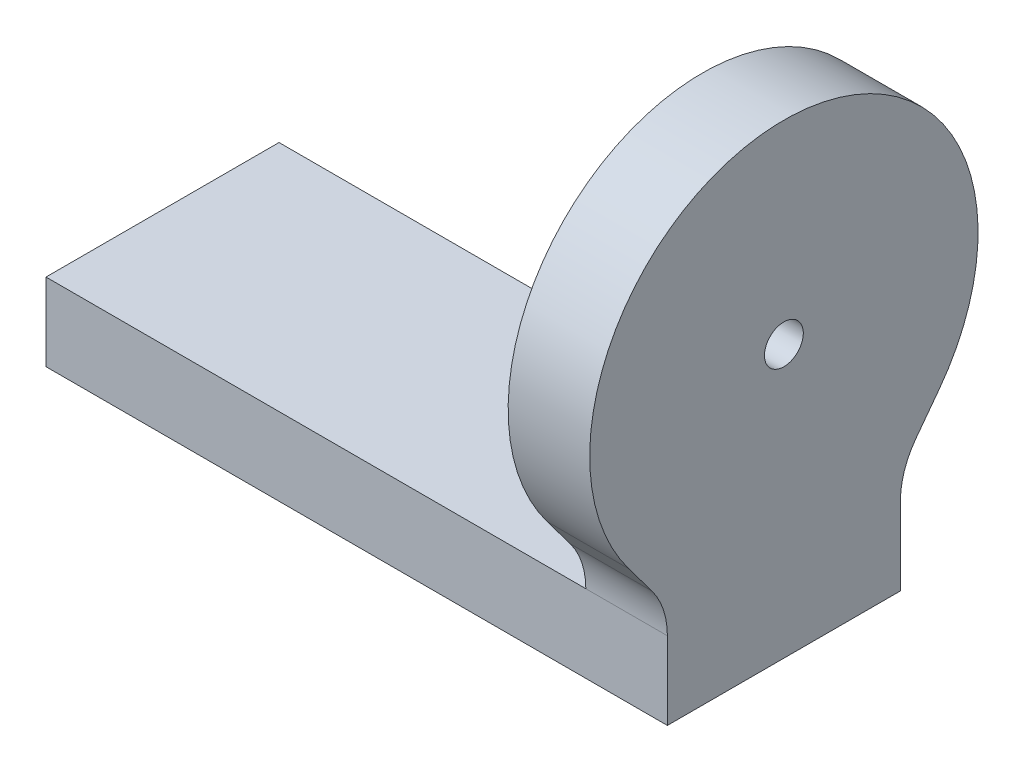
ISO-10303-21;
HEADER;
FILE_DESCRIPTION(('STEP AP214'),'2;1');
FILE_NAME('part.step','',(''),(''),'','','');
FILE_SCHEMA(('AUTOMOTIVE_DESIGN { 1 0 10303 214 1 1 1 1 }'));
ENDSEC;
DATA;
#1=APPLICATION_CONTEXT('core data for automotive mechanical design processes');
#2=APPLICATION_PROTOCOL_DEFINITION('international standard','automotive_design',2000,#1);
#3=PRODUCT_CONTEXT('',#1,'mechanical');
#4=PRODUCT('Part','Part','',(#3));
#5=PRODUCT_RELATED_PRODUCT_CATEGORY('part','',(#4));
#6=PRODUCT_DEFINITION_FORMATION('','',#4);
#7=PRODUCT_DEFINITION_CONTEXT('part definition',#1,'design');
#8=PRODUCT_DEFINITION('design','',#6,#7);
#9=PRODUCT_DEFINITION_SHAPE('','',#8);
#10=(LENGTH_UNIT() NAMED_UNIT(*) SI_UNIT(.MILLI.,.METRE.));
#11=(NAMED_UNIT(*) PLANE_ANGLE_UNIT() SI_UNIT($,.RADIAN.));
#12=(NAMED_UNIT(*) SI_UNIT($,.STERADIAN.) SOLID_ANGLE_UNIT());
#13=UNCERTAINTY_MEASURE_WITH_UNIT(LENGTH_MEASURE(1.E-05),#10,'distance_accuracy_value','');
#14=(GEOMETRIC_REPRESENTATION_CONTEXT(3) GLOBAL_UNCERTAINTY_ASSIGNED_CONTEXT((#13)) GLOBAL_UNIT_ASSIGNED_CONTEXT((#10,
#11,#12)) REPRESENTATION_CONTEXT('',''));
#15=CARTESIAN_POINT('',(0.,0.,0.));
#16=DIRECTION('',(0.,0.,1.));
#17=DIRECTION('',(1.,0.,0.));
#18=AXIS2_PLACEMENT_3D('',#15,#16,#17);
#19=CARTESIAN_POINT('',(29.5,60.,-50.));
#20=DIRECTION('',(-1.,0.,0.));
#21=DIRECTION('',(0.,0.,1.));
#22=AXIS2_PLACEMENT_3D('',#19,#20,#21);
#23=PLANE('',#22);
#24=CARTESIAN_POINT('',(29.5,35.,-25.));
#25=DIRECTION('',(-1.,0.,0.));
#26=DIRECTION('',(0.,0.,1.));
#27=AXIS2_PLACEMENT_3D('',#24,#25,#26);
#28=CIRCLE('',#27,2.5);
#29=CARTESIAN_POINT('',(29.5,35.,-22.5));
#30=VERTEX_POINT('',#29);
#31=EDGE_CURVE('E168',#30,#30,#28,.T.);
#32=ORIENTED_EDGE('',*,*,#31,.F.);
#33=EDGE_LOOP('',(#32));
#34=FACE_BOUND('',#33,.T.);
#35=DIRECTION('',(0.,-0.800010129343293,-0.599986493971429));
#36=VECTOR('',#35,1.);
#37=CARTESIAN_POINT('',(29.5,9.59970286834054,-12.800054018756));
#38=LINE('',#37,#36);
#39=CARTESIAN_POINT('',(29.5,19.9484136276116,-5.03879393236643));
#40=VERTEX_POINT('',#39);
#41=CARTESIAN_POINT('',(29.5,16.,-8.));
#42=VERTEX_POINT('',#41);
#43=EDGE_CURVE('E113',#40,#42,#38,.T.);
#44=ORIENTED_EDGE('',*,*,#43,.F.);
#45=CARTESIAN_POINT('',(29.5,35.,-25.));
#46=DIRECTION('',(-1.,0.,0.));
#47=DIRECTION('',(0.,0.,1.));
#48=AXIS2_PLACEMENT_3D('',#45,#46,#47);
#49=CIRCLE('',#48,25.);
#50=CARTESIAN_POINT('',(29.5,20.,-45.));
#51=VERTEX_POINT('',#50);
#52=EDGE_CURVE('E173',#40,#51,#49,.T.);
#53=ORIENTED_EDGE('',*,*,#52,.T.);
#54=DIRECTION('',(0.,-0.799999999999999,0.600000000000001));
#55=VECTOR('',#54,1.);
#56=CARTESIAN_POINT('',(29.5,-14.4,-19.1999999999999));
#57=LINE('',#56,#55);
#58=CARTESIAN_POINT('',(29.5,16.,-42.));
#59=VERTEX_POINT('',#58);
#60=EDGE_CURVE('E142',#51,#59,#57,.T.);
#61=ORIENTED_EDGE('',*,*,#60,.T.);
#62=CARTESIAN_POINT('',(29.5,10.,-50.));
#63=DIRECTION('',(-1.,0.,0.));
#64=DIRECTION('',(0.,0.,1.));
#65=AXIS2_PLACEMENT_3D('',#62,#63,#64);
#66=CIRCLE('',#65,10.);
#67=CARTESIAN_POINT('',(29.5,10.,-40.));
#68=VERTEX_POINT('',#67);
#69=EDGE_CURVE('E136',#68,#59,#66,.T.);
#70=ORIENTED_EDGE('',*,*,#69,.F.);
#71=DIRECTION('',(0.,0.,1.));
#72=VECTOR('',#71,1.);
#73=CARTESIAN_POINT('',(29.5,10.,-50.));
#74=LINE('',#73,#72);
#75=CARTESIAN_POINT('',(29.5,10.,-10.));
#76=VERTEX_POINT('',#75);
#77=EDGE_CURVE('E41',#68,#76,#74,.T.);
#78=ORIENTED_EDGE('',*,*,#77,.T.);
#79=CARTESIAN_POINT('',(29.5,10.,0.));
#80=DIRECTION('',(-1.,0.,0.));
#81=DIRECTION('',(0.,0.,1.));
#82=AXIS2_PLACEMENT_3D('',#79,#80,#81);
#83=CIRCLE('',#82,10.);
#84=EDGE_CURVE('E131',#42,#76,#83,.T.);
#85=ORIENTED_EDGE('',*,*,#84,.F.);
#86=EDGE_LOOP('',(#44,#53,#61,#70,#78,#85));
#87=FACE_BOUND('',#86,.T.);
#88=ADVANCED_FACE('F32',(#34,#87),#23,.T.);
#89=CARTESIAN_POINT('',(40.,60.,-50.));
#90=DIRECTION('',(-1.,0.,0.));
#91=DIRECTION('',(0.,-1.,0.));
#92=AXIS2_PLACEMENT_3D('',#89,#90,#91);
#93=PLANE('',#92);
#94=CARTESIAN_POINT('',(40.,35.,-25.));
#95=DIRECTION('',(-1.,0.,0.));
#96=DIRECTION('',(0.,0.,1.));
#97=AXIS2_PLACEMENT_3D('',#94,#95,#96);
#98=CIRCLE('',#97,2.5);
#99=CARTESIAN_POINT('',(40.,35.,-22.5));
#100=VERTEX_POINT('',#99);
#101=EDGE_CURVE('E170',#100,#100,#98,.T.);
#102=ORIENTED_EDGE('',*,*,#101,.T.);
#103=EDGE_LOOP('',(#102));
#104=FACE_BOUND('',#103,.T.);
#105=CARTESIAN_POINT('',(40.,35.,-25.));
#106=DIRECTION('',(-1.,0.,0.));
#107=DIRECTION('',(0.,0.,1.));
#108=AXIS2_PLACEMENT_3D('',#105,#106,#107);
#109=CIRCLE('',#108,25.);
#110=CARTESIAN_POINT('',(40.,19.9484136276116,-5.03879393236643));
#111=VERTEX_POINT('',#110);
#112=CARTESIAN_POINT('',(40.,20.,-45.));
#113=VERTEX_POINT('',#112);
#114=EDGE_CURVE('E129',#111,#113,#109,.T.);
#115=ORIENTED_EDGE('',*,*,#114,.F.);
#116=DIRECTION('',(0.,-0.800010129343293,-0.599986493971429));
#117=VECTOR('',#116,1.);
#118=CARTESIAN_POINT('',(40.,9.59970286834054,-12.800054018756));
#119=LINE('',#118,#117);
#120=CARTESIAN_POINT('',(40.,16.,-8.));
#121=VERTEX_POINT('',#120);
#122=EDGE_CURVE('E111',#111,#121,#119,.T.);
#123=ORIENTED_EDGE('',*,*,#122,.T.);
#124=CARTESIAN_POINT('',(40.,10.,0.));
#125=DIRECTION('',(-1.,0.,0.));
#126=DIRECTION('',(0.,0.,1.));
#127=AXIS2_PLACEMENT_3D('',#124,#125,#126);
#128=CIRCLE('',#127,10.);
#129=CARTESIAN_POINT('',(40.,10.,-10.));
#130=VERTEX_POINT('',#129);
#131=EDGE_CURVE('E117',#121,#130,#128,.T.);
#132=ORIENTED_EDGE('',*,*,#131,.T.);
#133=DIRECTION('',(0.,1.,0.));
#134=VECTOR('',#133,1.);
#135=CARTESIAN_POINT('',(40.,0.,-10.));
#136=LINE('',#135,#134);
#137=CARTESIAN_POINT('',(40.,0.,-10.));
#138=VERTEX_POINT('',#137);
#139=EDGE_CURVE('E156',#138,#130,#136,.T.);
#140=ORIENTED_EDGE('',*,*,#139,.F.);
#141=DIRECTION('',(0.,0.,1.));
#142=VECTOR('',#141,1.);
#143=CARTESIAN_POINT('',(40.,0.,-50.));
#144=LINE('',#143,#142);
#145=CARTESIAN_POINT('',(40.,0.,-40.));
#146=VERTEX_POINT('',#145);
#147=EDGE_CURVE('E179',#146,#138,#144,.T.);
#148=ORIENTED_EDGE('',*,*,#147,.F.);
#149=DIRECTION('',(0.,1.,0.));
#150=VECTOR('',#149,1.);
#151=CARTESIAN_POINT('',(40.,0.,-40.));
#152=LINE('',#151,#150);
#153=CARTESIAN_POINT('',(40.,10.,-40.));
#154=VERTEX_POINT('',#153);
#155=EDGE_CURVE('E57',#146,#154,#152,.T.);
#156=ORIENTED_EDGE('',*,*,#155,.T.);
#157=CARTESIAN_POINT('',(40.,10.,-50.));
#158=DIRECTION('',(-1.,0.,0.));
#159=DIRECTION('',(0.,0.,1.));
#160=AXIS2_PLACEMENT_3D('',#157,#158,#159);
#161=CIRCLE('',#160,10.);
#162=CARTESIAN_POINT('',(40.,16.,-42.));
#163=VERTEX_POINT('',#162);
#164=EDGE_CURVE('E138',#154,#163,#161,.T.);
#165=ORIENTED_EDGE('',*,*,#164,.T.);
#166=DIRECTION('',(0.,-0.799999999999999,0.600000000000001));
#167=VECTOR('',#166,1.);
#168=CARTESIAN_POINT('',(40.,-14.4,-19.1999999999999));
#169=LINE('',#168,#167);
#170=EDGE_CURVE('E141',#113,#163,#169,.T.);
#171=ORIENTED_EDGE('',*,*,#170,.F.);
#172=EDGE_LOOP('',(#115,#123,#132,#140,#148,#156,#165,#171));
#173=FACE_BOUND('',#172,.T.);
#174=ADVANCED_FACE('F127',(#104,#173),#93,.F.);
#175=CARTESIAN_POINT('',(-40.,10.,-50.));
#176=DIRECTION('',(-1.,0.,0.));
#177=DIRECTION('',(0.,0.,1.));
#178=AXIS2_PLACEMENT_3D('',#175,#176,#177);
#179=PLANE('',#178);
#180=DIRECTION('',(0.,1.,0.));
#181=VECTOR('',#180,1.);
#182=CARTESIAN_POINT('',(-40.,0.,-10.));
#183=LINE('',#182,#181);
#184=CARTESIAN_POINT('',(-40.,0.,-10.));
#185=VERTEX_POINT('',#184);
#186=CARTESIAN_POINT('',(-40.,10.,-10.));
#187=VERTEX_POINT('',#186);
#188=EDGE_CURVE('E49',#185,#187,#183,.T.);
#189=ORIENTED_EDGE('',*,*,#188,.T.);
#190=DIRECTION('',(0.,0.,1.));
#191=VECTOR('',#190,1.);
#192=CARTESIAN_POINT('',(-40.,10.,-50.));
#193=LINE('',#192,#191);
#194=CARTESIAN_POINT('',(-40.,10.,-40.));
#195=VERTEX_POINT('',#194);
#196=EDGE_CURVE('E11',#195,#187,#193,.T.);
#197=ORIENTED_EDGE('',*,*,#196,.F.);
#198=DIRECTION('',(0.,1.,0.));
#199=VECTOR('',#198,1.);
#200=CARTESIAN_POINT('',(-40.,0.,-40.));
#201=LINE('',#200,#199);
#202=CARTESIAN_POINT('',(-40.,0.,-40.));
#203=VERTEX_POINT('',#202);
#204=EDGE_CURVE('E163',#203,#195,#201,.T.);
#205=ORIENTED_EDGE('',*,*,#204,.F.);
#206=DIRECTION('',(0.,0.,1.));
#207=VECTOR('',#206,1.);
#208=CARTESIAN_POINT('',(-40.,0.,-50.));
#209=LINE('',#208,#207);
#210=EDGE_CURVE('E36',#203,#185,#209,.T.);
#211=ORIENTED_EDGE('',*,*,#210,.T.);
#212=EDGE_LOOP('',(#189,#197,#205,#211));
#213=FACE_BOUND('',#212,.T.);
#214=ADVANCED_FACE('F34',(#213),#179,.T.);
#215=CARTESIAN_POINT('',(-40.,10.,-50.));
#216=DIRECTION('',(0.,-1.,0.));
#217=DIRECTION('',(0.,0.,-1.));
#218=AXIS2_PLACEMENT_3D('',#215,#216,#217);
#219=PLANE('',#218);
#220=ORIENTED_EDGE('',*,*,#196,.T.);
#221=DIRECTION('',(-1.,0.,0.));
#222=VECTOR('',#221,1.);
#223=CARTESIAN_POINT('',(-40.,10.,-10.));
#224=LINE('',#223,#222);
#225=EDGE_CURVE('E152',#76,#187,#224,.T.);
#226=ORIENTED_EDGE('',*,*,#225,.F.);
#227=ORIENTED_EDGE('',*,*,#77,.F.);
#228=DIRECTION('',(1.,0.,0.));
#229=VECTOR('',#228,1.);
#230=CARTESIAN_POINT('',(-40.,10.,-40.));
#231=LINE('',#230,#229);
#232=EDGE_CURVE('E164',#195,#68,#231,.T.);
#233=ORIENTED_EDGE('',*,*,#232,.F.);
#234=EDGE_LOOP('',(#220,#226,#227,#233));
#235=FACE_BOUND('',#234,.T.);
#236=ADVANCED_FACE('F199',(#235),#219,.F.);
#237=CARTESIAN_POINT('',(-40.,0.,-50.));
#238=DIRECTION('',(0.,-1.,0.));
#239=DIRECTION('',(1.,0.,0.));
#240=AXIS2_PLACEMENT_3D('',#237,#238,#239);
#241=PLANE('',#240);
#242=DIRECTION('',(-1.,0.,0.));
#243=VECTOR('',#242,1.);
#244=CARTESIAN_POINT('',(-40.,0.,-10.));
#245=LINE('',#244,#243);
#246=EDGE_CURVE('E154',#138,#185,#245,.T.);
#247=ORIENTED_EDGE('',*,*,#246,.T.);
#248=ORIENTED_EDGE('',*,*,#210,.F.);
#249=DIRECTION('',(1.,0.,0.));
#250=VECTOR('',#249,1.);
#251=CARTESIAN_POINT('',(-40.,0.,-40.));
#252=LINE('',#251,#250);
#253=EDGE_CURVE('E161',#203,#146,#252,.T.);
#254=ORIENTED_EDGE('',*,*,#253,.T.);
#255=ORIENTED_EDGE('',*,*,#147,.T.);
#256=EDGE_LOOP('',(#247,#248,#254,#255));
#257=FACE_BOUND('',#256,.T.);
#258=ADVANCED_FACE('F188',(#257),#241,.T.);
#259=CARTESIAN_POINT('',(40.,35.,-25.));
#260=DIRECTION('',(-1.,0.,0.));
#261=DIRECTION('',(0.,0.,1.));
#262=AXIS2_PLACEMENT_3D('',#259,#260,#261);
#263=CYLINDRICAL_SURFACE('',#262,25.);
#264=ORIENTED_EDGE('',*,*,#52,.F.);
#265=DIRECTION('',(-1.,0.,0.));
#266=VECTOR('',#265,1.);
#267=CARTESIAN_POINT('',(40.,19.9484136276116,-5.03879393236643));
#268=LINE('',#267,#266);
#269=EDGE_CURVE('E116',#111,#40,#268,.T.);
#270=ORIENTED_EDGE('',*,*,#269,.F.);
#271=ORIENTED_EDGE('',*,*,#114,.T.);
#272=DIRECTION('',(-1.,0.,0.));
#273=VECTOR('',#272,1.);
#274=CARTESIAN_POINT('',(40.,20.,-45.));
#275=LINE('',#274,#273);
#276=EDGE_CURVE('E149',#113,#51,#275,.T.);
#277=ORIENTED_EDGE('',*,*,#276,.T.);
#278=EDGE_LOOP('',(#264,#270,#271,#277));
#279=FACE_BOUND('',#278,.T.);
#280=ADVANCED_FACE('F206',(#279),#263,.T.);
#281=CARTESIAN_POINT('',(40.,35.,-25.));
#282=DIRECTION('',(-1.,0.,0.));
#283=DIRECTION('',(0.,0.,1.));
#284=AXIS2_PLACEMENT_3D('',#281,#282,#283);
#285=CYLINDRICAL_SURFACE('',#284,2.5);
#286=ORIENTED_EDGE('',*,*,#101,.F.);
#287=EDGE_LOOP('',(#286));
#288=FACE_BOUND('',#287,.T.);
#289=ORIENTED_EDGE('',*,*,#31,.T.);
#290=EDGE_LOOP('',(#289));
#291=FACE_BOUND('',#290,.T.);
#292=ADVANCED_FACE('F208',(#288,#291),#285,.F.);
#293=CARTESIAN_POINT('',(-40.,0.,-40.));
#294=DIRECTION('',(0.,0.,1.));
#295=DIRECTION('',(1.,0.,0.));
#296=AXIS2_PLACEMENT_3D('',#293,#294,#295);
#297=PLANE('',#296);
#298=ORIENTED_EDGE('',*,*,#232,.T.);
#299=EDGE_CURVE('E159',#68,#154,#231,.T.);
#300=ORIENTED_EDGE('',*,*,#299,.T.);
#301=ORIENTED_EDGE('',*,*,#155,.F.);
#302=ORIENTED_EDGE('',*,*,#253,.F.);
#303=ORIENTED_EDGE('',*,*,#204,.T.);
#304=EDGE_LOOP('',(#298,#300,#301,#302,#303));
#305=FACE_BOUND('',#304,.T.);
#306=ADVANCED_FACE('F194',(#305),#297,.F.);
#307=CARTESIAN_POINT('',(-40.,0.,-10.));
#308=DIRECTION('',(0.,0.,-1.));
#309=DIRECTION('',(-1.,0.,0.));
#310=AXIS2_PLACEMENT_3D('',#307,#308,#309);
#311=PLANE('',#310);
#312=EDGE_CURVE('E122',#130,#76,#224,.T.);
#313=ORIENTED_EDGE('',*,*,#312,.T.);
#314=ORIENTED_EDGE('',*,*,#225,.T.);
#315=ORIENTED_EDGE('',*,*,#188,.F.);
#316=ORIENTED_EDGE('',*,*,#246,.F.);
#317=ORIENTED_EDGE('',*,*,#139,.T.);
#318=EDGE_LOOP('',(#313,#314,#315,#316,#317));
#319=FACE_BOUND('',#318,.T.);
#320=ADVANCED_FACE('F189',(#319),#311,.F.);
#321=CARTESIAN_POINT('',(40.,-14.4,-19.1999999999999));
#322=DIRECTION('',(0.,-0.600000000000001,-0.799999999999999));
#323=DIRECTION('',(0.,0.799999999999999,-0.600000000000001));
#324=AXIS2_PLACEMENT_3D('',#321,#322,#323);
#325=PLANE('',#324);
#326=ORIENTED_EDGE('',*,*,#60,.F.);
#327=ORIENTED_EDGE('',*,*,#276,.F.);
#328=ORIENTED_EDGE('',*,*,#170,.T.);
#329=DIRECTION('',(-1.,0.,0.));
#330=VECTOR('',#329,1.);
#331=CARTESIAN_POINT('',(40.,16.,-42.));
#332=LINE('',#331,#330);
#333=EDGE_CURVE('E144',#163,#59,#332,.T.);
#334=ORIENTED_EDGE('',*,*,#333,.T.);
#335=EDGE_LOOP('',(#326,#327,#328,#334));
#336=FACE_BOUND('',#335,.T.);
#337=ADVANCED_FACE('F204',(#336),#325,.T.);
#338=CARTESIAN_POINT('',(40.,10.,-50.));
#339=DIRECTION('',(-1.,0.,0.));
#340=DIRECTION('',(0.,0.,1.));
#341=AXIS2_PLACEMENT_3D('',#338,#339,#340);
#342=CYLINDRICAL_SURFACE('',#341,10.);
#343=ORIENTED_EDGE('',*,*,#69,.T.);
#344=ORIENTED_EDGE('',*,*,#333,.F.);
#345=ORIENTED_EDGE('',*,*,#164,.F.);
#346=ORIENTED_EDGE('',*,*,#299,.F.);
#347=EDGE_LOOP('',(#343,#344,#345,#346));
#348=FACE_BOUND('',#347,.T.);
#349=ADVANCED_FACE('F192',(#348),#342,.F.);
#350=CARTESIAN_POINT('',(40.,9.59970286834054,-12.800054018756));
#351=DIRECTION('',(0.,0.599986493971429,-0.800010129343293));
#352=DIRECTION('',(0.,0.800010129343293,0.599986493971429));
#353=AXIS2_PLACEMENT_3D('',#350,#351,#352);
#354=PLANE('',#353);
#355=ORIENTED_EDGE('',*,*,#43,.T.);
#356=DIRECTION('',(-1.,0.,0.));
#357=VECTOR('',#356,1.);
#358=CARTESIAN_POINT('',(40.,16.,-8.));
#359=LINE('',#358,#357);
#360=EDGE_CURVE('E106',#121,#42,#359,.T.);
#361=ORIENTED_EDGE('',*,*,#360,.F.);
#362=ORIENTED_EDGE('',*,*,#122,.F.);
#363=ORIENTED_EDGE('',*,*,#269,.T.);
#364=EDGE_LOOP('',(#355,#361,#362,#363));
#365=FACE_BOUND('',#364,.T.);
#366=ADVANCED_FACE('F108',(#365),#354,.F.);
#367=CARTESIAN_POINT('',(40.,10.,0.));
#368=DIRECTION('',(-1.,0.,0.));
#369=DIRECTION('',(0.,0.,1.));
#370=AXIS2_PLACEMENT_3D('',#367,#368,#369);
#371=CYLINDRICAL_SURFACE('',#370,10.);
#372=ORIENTED_EDGE('',*,*,#84,.T.);
#373=ORIENTED_EDGE('',*,*,#312,.F.);
#374=ORIENTED_EDGE('',*,*,#131,.F.);
#375=ORIENTED_EDGE('',*,*,#360,.T.);
#376=EDGE_LOOP('',(#372,#373,#374,#375));
#377=FACE_BOUND('',#376,.T.);
#378=ADVANCED_FACE('F120',(#377),#371,.F.);
#379=CLOSED_SHELL('',(#88,#174,#214,#236,#258,#280,#292,#306,#320,#337,#349,#366,#378));
#380=MANIFOLD_SOLID_BREP('B2',#379);
#381=ADVANCED_BREP_SHAPE_REPRESENTATION('',(#18,#380),#14);
#382=SHAPE_DEFINITION_REPRESENTATION(#9,#381);
ENDSEC;
END-ISO-10303-21;
